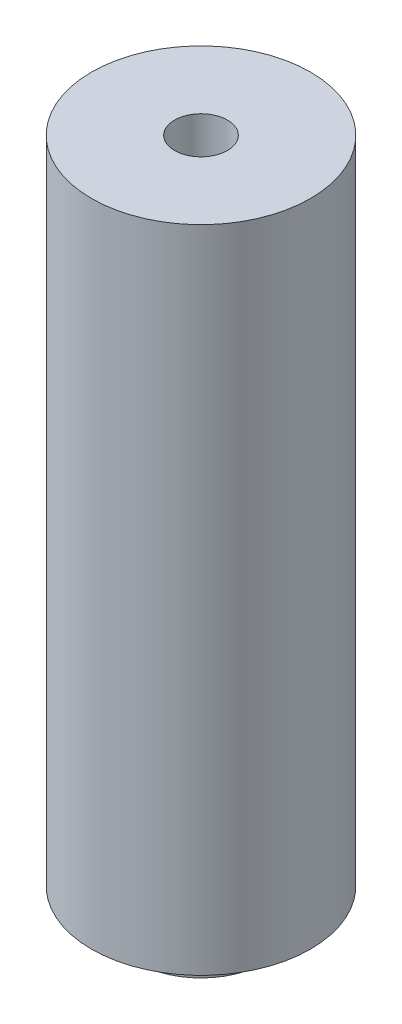
ISO-10303-21;
HEADER;
FILE_DESCRIPTION(('STEP AP214'),'2;1');
FILE_NAME('part.step','',(''),(''),'','','');
FILE_SCHEMA(('AUTOMOTIVE_DESIGN { 1 0 10303 214 1 1 1 1 }'));
ENDSEC;
DATA;
#1=APPLICATION_CONTEXT('core data for automotive mechanical design processes');
#2=APPLICATION_PROTOCOL_DEFINITION('international standard','automotive_design',2000,#1);
#3=PRODUCT_CONTEXT('',#1,'mechanical');
#4=PRODUCT('Part','Part','',(#3));
#5=PRODUCT_RELATED_PRODUCT_CATEGORY('part','',(#4));
#6=PRODUCT_DEFINITION_FORMATION('','',#4);
#7=PRODUCT_DEFINITION_CONTEXT('part definition',#1,'design');
#8=PRODUCT_DEFINITION('design','',#6,#7);
#9=PRODUCT_DEFINITION_SHAPE('','',#8);
#10=(LENGTH_UNIT() NAMED_UNIT(*) SI_UNIT(.MILLI.,.METRE.));
#11=(NAMED_UNIT(*) PLANE_ANGLE_UNIT() SI_UNIT($,.RADIAN.));
#12=(NAMED_UNIT(*) SI_UNIT($,.STERADIAN.) SOLID_ANGLE_UNIT());
#13=UNCERTAINTY_MEASURE_WITH_UNIT(LENGTH_MEASURE(1.E-05),#10,'distance_accuracy_value','');
#14=(GEOMETRIC_REPRESENTATION_CONTEXT(3) GLOBAL_UNCERTAINTY_ASSIGNED_CONTEXT((#13)) GLOBAL_UNIT_ASSIGNED_CONTEXT((#10,
#11,#12)) REPRESENTATION_CONTEXT('',''));
#15=CARTESIAN_POINT('',(0.,0.,0.));
#16=DIRECTION('',(0.,0.,1.));
#17=DIRECTION('',(1.,0.,0.));
#18=AXIS2_PLACEMENT_3D('',#15,#16,#17);
#19=CARTESIAN_POINT('',(0.,0.,0.));
#20=DIRECTION('',(0.,1.,0.));
#21=DIRECTION('',(0.,0.,1.));
#22=AXIS2_PLACEMENT_3D('',#19,#20,#21);
#23=PLANE('',#22);
#24=CARTESIAN_POINT('',(0.,0.,0.));
#25=DIRECTION('',(0.,1.,0.));
#26=DIRECTION('',(0.,0.,1.));
#27=AXIS2_PLACEMENT_3D('',#24,#25,#26);
#28=CIRCLE('',#27,0.965);
#29=CARTESIAN_POINT('',(0.,0.,0.965));
#30=VERTEX_POINT('',#29);
#31=EDGE_CURVE('E43',#30,#30,#28,.T.);
#32=ORIENTED_EDGE('',*,*,#31,.T.);
#33=EDGE_LOOP('',(#32));
#34=FACE_BOUND('',#33,.T.);
#35=CARTESIAN_POINT('',(0.,0.,0.));
#36=DIRECTION('',(0.,-1.,0.));
#37=DIRECTION('',(0.,0.,-1.));
#38=AXIS2_PLACEMENT_3D('',#35,#36,#37);
#39=CIRCLE('',#38,2.35);
#40=CARTESIAN_POINT('',(0.,0.,-2.35));
#41=VERTEX_POINT('',#40);
#42=EDGE_CURVE('E53',#41,#41,#39,.T.);
#43=ORIENTED_EDGE('',*,*,#42,.T.);
#44=EDGE_LOOP('',(#43));
#45=FACE_BOUND('',#44,.T.);
#46=ADVANCED_FACE('F32',(#34,#45),#23,.F.);
#47=CARTESIAN_POINT('',(0.,25.,0.));
#48=DIRECTION('',(0.,-1.,0.));
#49=DIRECTION('',(0.,0.,-1.));
#50=AXIS2_PLACEMENT_3D('',#47,#48,#49);
#51=CYLINDRICAL_SURFACE('',#50,4.);
#52=CARTESIAN_POINT('',(0.,25.,0.));
#53=DIRECTION('',(0.,1.,0.));
#54=DIRECTION('',(0.,0.,1.));
#55=AXIS2_PLACEMENT_3D('',#52,#53,#54);
#56=CIRCLE('',#55,4.);
#57=CARTESIAN_POINT('',(0.,25.,4.));
#58=VERTEX_POINT('',#57);
#59=EDGE_CURVE('E10',#58,#58,#56,.T.);
#60=ORIENTED_EDGE('',*,*,#59,.F.);
#61=EDGE_LOOP('',(#60));
#62=FACE_BOUND('',#61,.T.);
#63=CARTESIAN_POINT('',(0.,1.25,0.));
#64=DIRECTION('',(0.,-1.,0.));
#65=DIRECTION('',(0.,0.,-1.));
#66=AXIS2_PLACEMENT_3D('',#63,#64,#65);
#67=CIRCLE('',#66,4.);
#68=CARTESIAN_POINT('',(0.,1.25,-4.));
#69=VERTEX_POINT('',#68);
#70=EDGE_CURVE('E48',#69,#69,#67,.T.);
#71=ORIENTED_EDGE('',*,*,#70,.F.);
#72=EDGE_LOOP('',(#71));
#73=FACE_BOUND('',#72,.T.);
#74=ADVANCED_FACE('F34',(#62,#73),#51,.T.);
#75=CARTESIAN_POINT('',(0.,25.,0.));
#76=DIRECTION('',(0.,1.,0.));
#77=DIRECTION('',(0.,0.,1.));
#78=AXIS2_PLACEMENT_3D('',#75,#76,#77);
#79=PLANE('',#78);
#80=ORIENTED_EDGE('',*,*,#59,.T.);
#81=EDGE_LOOP('',(#80));
#82=FACE_BOUND('',#81,.T.);
#83=CARTESIAN_POINT('',(0.,25.,0.));
#84=DIRECTION('',(0.,1.,0.));
#85=DIRECTION('',(0.,0.,1.));
#86=AXIS2_PLACEMENT_3D('',#83,#84,#85);
#87=CIRCLE('',#86,0.965);
#88=CARTESIAN_POINT('',(0.,25.,0.965));
#89=VERTEX_POINT('',#88);
#90=EDGE_CURVE('E39',#89,#89,#87,.T.);
#91=ORIENTED_EDGE('',*,*,#90,.F.);
#92=EDGE_LOOP('',(#91));
#93=FACE_BOUND('',#92,.T.);
#94=ADVANCED_FACE('F70',(#82,#93),#79,.T.);
#95=CARTESIAN_POINT('',(0.,25.,0.));
#96=DIRECTION('',(0.,-1.,0.));
#97=DIRECTION('',(0.,0.,-1.));
#98=AXIS2_PLACEMENT_3D('',#95,#96,#97);
#99=CYLINDRICAL_SURFACE('',#98,0.965);
#100=ORIENTED_EDGE('',*,*,#90,.T.);
#101=EDGE_LOOP('',(#100));
#102=FACE_BOUND('',#101,.T.);
#103=ORIENTED_EDGE('',*,*,#31,.F.);
#104=EDGE_LOOP('',(#103));
#105=FACE_BOUND('',#104,.T.);
#106=ADVANCED_FACE('F65',(#102,#105),#99,.F.);
#107=CARTESIAN_POINT('',(0.,1.25,0.));
#108=DIRECTION('',(0.,-1.,0.));
#109=DIRECTION('',(0.,0.,-1.));
#110=AXIS2_PLACEMENT_3D('',#107,#108,#109);
#111=PLANE('',#110);
#112=CARTESIAN_POINT('',(0.,1.25,0.));
#113=DIRECTION('',(0.,-1.,0.));
#114=DIRECTION('',(0.,0.,-1.));
#115=AXIS2_PLACEMENT_3D('',#112,#113,#114);
#116=CIRCLE('',#115,2.35);
#117=CARTESIAN_POINT('',(0.,1.25,-2.35));
#118=VERTEX_POINT('',#117);
#119=EDGE_CURVE('E52',#118,#118,#116,.T.);
#120=ORIENTED_EDGE('',*,*,#119,.F.);
#121=EDGE_LOOP('',(#120));
#122=FACE_BOUND('',#121,.T.);
#123=ORIENTED_EDGE('',*,*,#70,.T.);
#124=EDGE_LOOP('',(#123));
#125=FACE_BOUND('',#124,.T.);
#126=ADVANCED_FACE('F62',(#122,#125),#111,.T.);
#127=CARTESIAN_POINT('',(0.,1.25,0.));
#128=DIRECTION('',(0.,-1.,0.));
#129=DIRECTION('',(0.,0.,-1.));
#130=AXIS2_PLACEMENT_3D('',#127,#128,#129);
#131=CYLINDRICAL_SURFACE('',#130,2.35);
#132=ORIENTED_EDGE('',*,*,#119,.T.);
#133=EDGE_LOOP('',(#132));
#134=FACE_BOUND('',#133,.T.);
#135=ORIENTED_EDGE('',*,*,#42,.F.);
#136=EDGE_LOOP('',(#135));
#137=FACE_BOUND('',#136,.T.);
#138=ADVANCED_FACE('F59',(#134,#137),#131,.T.);
#139=CLOSED_SHELL('',(#46,#74,#94,#106,#126,#138));
#140=MANIFOLD_SOLID_BREP('B2',#139);
#141=ADVANCED_BREP_SHAPE_REPRESENTATION('',(#18,#140),#14);
#142=SHAPE_DEFINITION_REPRESENTATION(#9,#141);
ENDSEC;
END-ISO-10303-21;
